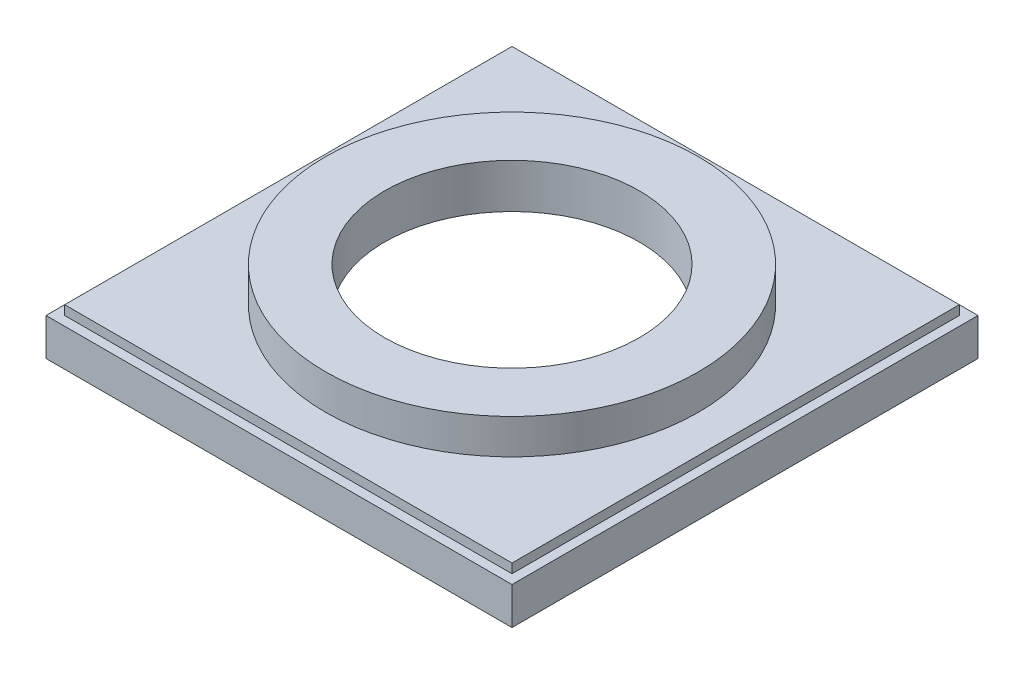
ISO-10303-21;
HEADER;
FILE_DESCRIPTION(('STEP AP214'),'2;1');
FILE_NAME('part.step','',(''),(''),'','','');
FILE_SCHEMA(('AUTOMOTIVE_DESIGN { 1 0 10303 214 1 1 1 1 }'));
ENDSEC;
DATA;
#1=APPLICATION_CONTEXT('core data for automotive mechanical design processes');
#2=APPLICATION_PROTOCOL_DEFINITION('international standard','automotive_design',2000,#1);
#3=PRODUCT_CONTEXT('',#1,'mechanical');
#4=PRODUCT('Part','Part','',(#3));
#5=PRODUCT_RELATED_PRODUCT_CATEGORY('part','',(#4));
#6=PRODUCT_DEFINITION_FORMATION('','',#4);
#7=PRODUCT_DEFINITION_CONTEXT('part definition',#1,'design');
#8=PRODUCT_DEFINITION('design','',#6,#7);
#9=PRODUCT_DEFINITION_SHAPE('','',#8);
#10=(LENGTH_UNIT() NAMED_UNIT(*) SI_UNIT(.MILLI.,.METRE.));
#11=(NAMED_UNIT(*) PLANE_ANGLE_UNIT() SI_UNIT($,.RADIAN.));
#12=(NAMED_UNIT(*) SI_UNIT($,.STERADIAN.) SOLID_ANGLE_UNIT());
#13=UNCERTAINTY_MEASURE_WITH_UNIT(LENGTH_MEASURE(1.E-05),#10,'distance_accuracy_value','');
#14=(GEOMETRIC_REPRESENTATION_CONTEXT(3) GLOBAL_UNCERTAINTY_ASSIGNED_CONTEXT((#13)) GLOBAL_UNIT_ASSIGNED_CONTEXT((#10,
#11,#12)) REPRESENTATION_CONTEXT('',''));
#15=CARTESIAN_POINT('',(0.,0.,0.));
#16=DIRECTION('',(0.,0.,1.));
#17=DIRECTION('',(1.,0.,0.));
#18=AXIS2_PLACEMENT_3D('',#15,#16,#17);
#19=CARTESIAN_POINT('',(0.,25.4,0.));
#20=DIRECTION('',(0.,1.,0.));
#21=DIRECTION('',(0.,0.,1.));
#22=AXIS2_PLACEMENT_3D('',#19,#20,#21);
#23=PLANE('',#22);
#24=DIRECTION('',(1.,0.,0.));
#25=VECTOR('',#24,1.);
#26=CARTESIAN_POINT('',(-152.4,25.4,152.4));
#27=LINE('',#26,#25);
#28=CARTESIAN_POINT('',(-152.4,25.4,152.4));
#29=VERTEX_POINT('',#28);
#30=CARTESIAN_POINT('',(152.4,25.4,152.4));
#31=VERTEX_POINT('',#30);
#32=EDGE_CURVE('E68',#29,#31,#27,.T.);
#33=ORIENTED_EDGE('',*,*,#32,.F.);
#34=DIRECTION('',(0.,0.,1.));
#35=VECTOR('',#34,1.);
#36=CARTESIAN_POINT('',(-152.4,25.4,-152.4));
#37=LINE('',#36,#35);
#38=CARTESIAN_POINT('',(-152.4,25.4,-152.4));
#39=VERTEX_POINT('',#38);
#40=EDGE_CURVE('E72',#39,#29,#37,.T.);
#41=ORIENTED_EDGE('',*,*,#40,.F.);
#42=DIRECTION('',(-1.,0.,0.));
#43=VECTOR('',#42,1.);
#44=CARTESIAN_POINT('',(152.4,25.4,-152.4));
#45=LINE('',#44,#43);
#46=CARTESIAN_POINT('',(152.4,25.4,-152.4));
#47=VERTEX_POINT('',#46);
#48=EDGE_CURVE('E495',#47,#39,#45,.T.);
#49=ORIENTED_EDGE('',*,*,#48,.F.);
#50=DIRECTION('',(0.,0.,-1.));
#51=VECTOR('',#50,1.);
#52=CARTESIAN_POINT('',(152.4,25.4,152.4));
#53=LINE('',#52,#51);
#54=EDGE_CURVE('E492',#31,#47,#53,.T.);
#55=ORIENTED_EDGE('',*,*,#54,.F.);
#56=EDGE_LOOP('',(#33,#41,#49,#55));
#57=FACE_BOUND('',#56,.T.);
#58=DIRECTION('',(0.,0.,-1.));
#59=VECTOR('',#58,1.);
#60=CARTESIAN_POINT('',(158.75,25.4,-158.75));
#61=LINE('',#60,#59);
#62=CARTESIAN_POINT('',(158.75,25.4,158.75));
#63=VERTEX_POINT('',#62);
#64=CARTESIAN_POINT('',(158.75,25.4,-158.75));
#65=VERTEX_POINT('',#64);
#66=EDGE_CURVE('E218',#63,#65,#61,.T.);
#67=ORIENTED_EDGE('',*,*,#66,.T.);
#68=DIRECTION('',(-1.,0.,0.));
#69=VECTOR('',#68,1.);
#70=CARTESIAN_POINT('',(-158.75,25.4,-158.75));
#71=LINE('',#70,#69);
#72=CARTESIAN_POINT('',(-158.75,25.4,-158.75));
#73=VERTEX_POINT('',#72);
#74=EDGE_CURVE('E222',#65,#73,#71,.T.);
#75=ORIENTED_EDGE('',*,*,#74,.T.);
#76=DIRECTION('',(0.,0.,1.));
#77=VECTOR('',#76,1.);
#78=CARTESIAN_POINT('',(-158.75,25.4,-158.75));
#79=LINE('',#78,#77);
#80=CARTESIAN_POINT('',(-158.75,25.4,158.75));
#81=VERTEX_POINT('',#80);
#82=EDGE_CURVE('E226',#73,#81,#79,.T.);
#83=ORIENTED_EDGE('',*,*,#82,.T.);
#84=DIRECTION('',(1.,0.,0.));
#85=VECTOR('',#84,1.);
#86=CARTESIAN_POINT('',(-158.75,25.4,158.75));
#87=LINE('',#86,#85);
#88=EDGE_CURVE('E229',#81,#63,#87,.T.);
#89=ORIENTED_EDGE('',*,*,#88,.T.);
#90=EDGE_LOOP('',(#67,#75,#83,#89));
#91=FACE_BOUND('',#90,.T.);
#92=ADVANCED_FACE('F51',(#57,#91),#23,.T.);
#93=CARTESIAN_POINT('',(0.,0.,0.));
#94=DIRECTION('',(0.,1.,0.));
#95=DIRECTION('',(0.,0.,1.));
#96=AXIS2_PLACEMENT_3D('',#93,#94,#95);
#97=PLANE('',#96);
#98=DIRECTION('',(0.,0.,-1.));
#99=VECTOR('',#98,1.);
#100=CARTESIAN_POINT('',(158.75,0.,-158.75));
#101=LINE('',#100,#99);
#102=CARTESIAN_POINT('',(158.75,0.,158.75));
#103=VERTEX_POINT('',#102);
#104=CARTESIAN_POINT('',(158.75,0.,-158.75));
#105=VERTEX_POINT('',#104);
#106=EDGE_CURVE('E217',#103,#105,#101,.T.);
#107=ORIENTED_EDGE('',*,*,#106,.F.);
#108=DIRECTION('',(1.,0.,0.));
#109=VECTOR('',#108,1.);
#110=CARTESIAN_POINT('',(-158.75,0.,158.75));
#111=LINE('',#110,#109);
#112=CARTESIAN_POINT('',(-158.75,0.,158.75));
#113=VERTEX_POINT('',#112);
#114=EDGE_CURVE('E223',#113,#103,#111,.T.);
#115=ORIENTED_EDGE('',*,*,#114,.F.);
#116=DIRECTION('',(0.,0.,1.));
#117=VECTOR('',#116,1.);
#118=CARTESIAN_POINT('',(-158.75,0.,-158.75));
#119=LINE('',#118,#117);
#120=CARTESIAN_POINT('',(-158.75,0.,-158.75));
#121=VERTEX_POINT('',#120);
#122=EDGE_CURVE('E239',#121,#113,#119,.T.);
#123=ORIENTED_EDGE('',*,*,#122,.F.);
#124=DIRECTION('',(-1.,0.,0.));
#125=VECTOR('',#124,1.);
#126=CARTESIAN_POINT('',(-158.75,0.,-158.75));
#127=LINE('',#126,#125);
#128=EDGE_CURVE('E236',#105,#121,#127,.T.);
#129=ORIENTED_EDGE('',*,*,#128,.F.);
#130=EDGE_LOOP('',(#107,#115,#123,#129));
#131=FACE_BOUND('',#130,.T.);
#132=DIRECTION('',(-1.,0.,0.));
#133=VECTOR('',#132,1.);
#134=CARTESIAN_POINT('',(-133.35,0.,-133.35));
#135=LINE('',#134,#133);
#136=CARTESIAN_POINT('',(133.35,0.,-133.35));
#137=VERTEX_POINT('',#136);
#138=CARTESIAN_POINT('',(-133.35,0.,-133.35));
#139=VERTEX_POINT('',#138);
#140=EDGE_CURVE('E165',#137,#139,#135,.T.);
#141=ORIENTED_EDGE('',*,*,#140,.T.);
#142=DIRECTION('',(0.,0.,1.));
#143=VECTOR('',#142,1.);
#144=CARTESIAN_POINT('',(-133.35,0.,-133.35));
#145=LINE('',#144,#143);
#146=CARTESIAN_POINT('',(-133.35,0.,133.35));
#147=VERTEX_POINT('',#146);
#148=EDGE_CURVE('E170',#139,#147,#145,.T.);
#149=ORIENTED_EDGE('',*,*,#148,.T.);
#150=DIRECTION('',(1.,0.,0.));
#151=VECTOR('',#150,1.);
#152=CARTESIAN_POINT('',(-133.35,0.,133.35));
#153=LINE('',#152,#151);
#154=CARTESIAN_POINT('',(133.35,0.,133.35));
#155=VERTEX_POINT('',#154);
#156=EDGE_CURVE('E197',#147,#155,#153,.T.);
#157=ORIENTED_EDGE('',*,*,#156,.T.);
#158=DIRECTION('',(0.,0.,-1.));
#159=VECTOR('',#158,1.);
#160=CARTESIAN_POINT('',(133.35,0.,-133.35));
#161=LINE('',#160,#159);
#162=EDGE_CURVE('E181',#155,#137,#161,.T.);
#163=ORIENTED_EDGE('',*,*,#162,.T.);
#164=EDGE_LOOP('',(#141,#149,#157,#163));
#165=FACE_BOUND('',#164,.T.);
#166=ADVANCED_FACE('F268',(#131,#165),#97,.F.);
#167=CARTESIAN_POINT('',(158.75,25.4,-158.75));
#168=DIRECTION('',(-1.,0.,0.));
#169=DIRECTION('',(0.,0.,1.));
#170=AXIS2_PLACEMENT_3D('',#167,#168,#169);
#171=PLANE('',#170);
#172=ORIENTED_EDGE('',*,*,#106,.T.);
#173=DIRECTION('',(0.,-1.,0.));
#174=VECTOR('',#173,1.);
#175=CARTESIAN_POINT('',(158.75,25.4,-158.75));
#176=LINE('',#175,#174);
#177=EDGE_CURVE('E55',#65,#105,#176,.T.);
#178=ORIENTED_EDGE('',*,*,#177,.F.);
#179=ORIENTED_EDGE('',*,*,#66,.F.);
#180=DIRECTION('',(0.,-1.,0.));
#181=VECTOR('',#180,1.);
#182=CARTESIAN_POINT('',(158.75,25.4,158.75));
#183=LINE('',#182,#181);
#184=EDGE_CURVE('E232',#63,#103,#183,.T.);
#185=ORIENTED_EDGE('',*,*,#184,.T.);
#186=EDGE_LOOP('',(#172,#178,#179,#185));
#187=FACE_BOUND('',#186,.T.);
#188=ADVANCED_FACE('F53',(#187),#171,.F.);
#189=CARTESIAN_POINT('',(-158.75,25.4,-158.75));
#190=DIRECTION('',(0.,0.,1.));
#191=DIRECTION('',(1.,0.,0.));
#192=AXIS2_PLACEMENT_3D('',#189,#190,#191);
#193=PLANE('',#192);
#194=ORIENTED_EDGE('',*,*,#128,.T.);
#195=DIRECTION('',(0.,-1.,0.));
#196=VECTOR('',#195,1.);
#197=CARTESIAN_POINT('',(-158.75,25.4,-158.75));
#198=LINE('',#197,#196);
#199=EDGE_CURVE('E250',#73,#121,#198,.T.);
#200=ORIENTED_EDGE('',*,*,#199,.F.);
#201=ORIENTED_EDGE('',*,*,#74,.F.);
#202=ORIENTED_EDGE('',*,*,#177,.T.);
#203=EDGE_LOOP('',(#194,#200,#201,#202));
#204=FACE_BOUND('',#203,.T.);
#205=ADVANCED_FACE('F261',(#204),#193,.F.);
#206=CARTESIAN_POINT('',(-158.75,25.4,-158.75));
#207=DIRECTION('',(1.,0.,0.));
#208=DIRECTION('',(0.,0.,-1.));
#209=AXIS2_PLACEMENT_3D('',#206,#207,#208);
#210=PLANE('',#209);
#211=ORIENTED_EDGE('',*,*,#122,.T.);
#212=DIRECTION('',(0.,-1.,0.));
#213=VECTOR('',#212,1.);
#214=CARTESIAN_POINT('',(-158.75,25.4,158.75));
#215=LINE('',#214,#213);
#216=EDGE_CURVE('E247',#81,#113,#215,.T.);
#217=ORIENTED_EDGE('',*,*,#216,.F.);
#218=ORIENTED_EDGE('',*,*,#82,.F.);
#219=ORIENTED_EDGE('',*,*,#199,.T.);
#220=EDGE_LOOP('',(#211,#217,#218,#219));
#221=FACE_BOUND('',#220,.T.);
#222=ADVANCED_FACE('F271',(#221),#210,.F.);
#223=CARTESIAN_POINT('',(-158.75,25.4,158.75));
#224=DIRECTION('',(0.,0.,-1.));
#225=DIRECTION('',(-1.,0.,0.));
#226=AXIS2_PLACEMENT_3D('',#223,#224,#225);
#227=PLANE('',#226);
#228=ORIENTED_EDGE('',*,*,#114,.T.);
#229=ORIENTED_EDGE('',*,*,#184,.F.);
#230=ORIENTED_EDGE('',*,*,#88,.F.);
#231=ORIENTED_EDGE('',*,*,#216,.T.);
#232=EDGE_LOOP('',(#228,#229,#230,#231));
#233=FACE_BOUND('',#232,.T.);
#234=ADVANCED_FACE('F274',(#233),#227,.F.);
#235=CARTESIAN_POINT('',(-133.35,25.4,-133.35));
#236=DIRECTION('',(0.,0.,1.));
#237=DIRECTION('',(1.,0.,0.));
#238=AXIS2_PLACEMENT_3D('',#235,#236,#237);
#239=PLANE('',#238);
#240=ORIENTED_EDGE('',*,*,#140,.F.);
#241=DIRECTION('',(0.,-1.,0.));
#242=VECTOR('',#241,1.);
#243=CARTESIAN_POINT('',(133.35,25.4,-133.35));
#244=LINE('',#243,#242);
#245=CARTESIAN_POINT('',(133.35,25.4,-133.35));
#246=VERTEX_POINT('',#245);
#247=EDGE_CURVE('E192',#246,#137,#244,.T.);
#248=ORIENTED_EDGE('',*,*,#247,.F.);
#249=DIRECTION('',(-1.,0.,0.));
#250=VECTOR('',#249,1.);
#251=CARTESIAN_POINT('',(-133.35,25.4,-133.35));
#252=LINE('',#251,#250);
#253=CARTESIAN_POINT('',(-133.35,25.4,-133.35));
#254=VERTEX_POINT('',#253);
#255=EDGE_CURVE('E176',#246,#254,#252,.T.);
#256=ORIENTED_EDGE('',*,*,#255,.T.);
#257=DIRECTION('',(0.,-1.,0.));
#258=VECTOR('',#257,1.);
#259=CARTESIAN_POINT('',(-133.35,25.4,-133.35));
#260=LINE('',#259,#258);
#261=EDGE_CURVE('E213',#254,#139,#260,.T.);
#262=ORIENTED_EDGE('',*,*,#261,.T.);
#263=EDGE_LOOP('',(#240,#248,#256,#262));
#264=FACE_BOUND('',#263,.T.);
#265=ADVANCED_FACE('F285',(#264),#239,.T.);
#266=CARTESIAN_POINT('',(-133.35,25.4,-133.35));
#267=DIRECTION('',(1.,0.,0.));
#268=DIRECTION('',(0.,0.,-1.));
#269=AXIS2_PLACEMENT_3D('',#266,#267,#268);
#270=PLANE('',#269);
#271=ORIENTED_EDGE('',*,*,#148,.F.);
#272=ORIENTED_EDGE('',*,*,#261,.F.);
#273=DIRECTION('',(0.,0.,1.));
#274=VECTOR('',#273,1.);
#275=CARTESIAN_POINT('',(-133.35,25.4,-133.35));
#276=LINE('',#275,#274);
#277=CARTESIAN_POINT('',(-133.35,25.4,133.35));
#278=VERTEX_POINT('',#277);
#279=EDGE_CURVE('E180',#254,#278,#276,.T.);
#280=ORIENTED_EDGE('',*,*,#279,.T.);
#281=DIRECTION('',(0.,-1.,0.));
#282=VECTOR('',#281,1.);
#283=CARTESIAN_POINT('',(-133.35,25.4,133.35));
#284=LINE('',#283,#282);
#285=EDGE_CURVE('E210',#278,#147,#284,.T.);
#286=ORIENTED_EDGE('',*,*,#285,.T.);
#287=EDGE_LOOP('',(#271,#272,#280,#286));
#288=FACE_BOUND('',#287,.T.);
#289=ADVANCED_FACE('F328',(#288),#270,.T.);
#290=CARTESIAN_POINT('',(-133.35,25.4,133.35));
#291=DIRECTION('',(0.,0.,-1.));
#292=DIRECTION('',(-1.,0.,0.));
#293=AXIS2_PLACEMENT_3D('',#290,#291,#292);
#294=PLANE('',#293);
#295=ORIENTED_EDGE('',*,*,#156,.F.);
#296=ORIENTED_EDGE('',*,*,#285,.F.);
#297=DIRECTION('',(1.,0.,0.));
#298=VECTOR('',#297,1.);
#299=CARTESIAN_POINT('',(-133.35,25.4,133.35));
#300=LINE('',#299,#298);
#301=CARTESIAN_POINT('',(133.35,25.4,133.35));
#302=VERTEX_POINT('',#301);
#303=EDGE_CURVE('E185',#278,#302,#300,.T.);
#304=ORIENTED_EDGE('',*,*,#303,.T.);
#305=DIRECTION('',(0.,-1.,0.));
#306=VECTOR('',#305,1.);
#307=CARTESIAN_POINT('',(133.35,25.4,133.35));
#308=LINE('',#307,#306);
#309=EDGE_CURVE('E207',#302,#155,#308,.T.);
#310=ORIENTED_EDGE('',*,*,#309,.T.);
#311=EDGE_LOOP('',(#295,#296,#304,#310));
#312=FACE_BOUND('',#311,.T.);
#313=ADVANCED_FACE('F336',(#312),#294,.T.);
#314=CARTESIAN_POINT('',(133.35,25.4,-133.35));
#315=DIRECTION('',(-1.,0.,0.));
#316=DIRECTION('',(0.,0.,1.));
#317=AXIS2_PLACEMENT_3D('',#314,#315,#316);
#318=PLANE('',#317);
#319=ORIENTED_EDGE('',*,*,#162,.F.);
#320=ORIENTED_EDGE('',*,*,#309,.F.);
#321=DIRECTION('',(0.,0.,-1.));
#322=VECTOR('',#321,1.);
#323=CARTESIAN_POINT('',(133.35,25.4,-133.35));
#324=LINE('',#323,#322);
#325=EDGE_CURVE('E189',#302,#246,#324,.T.);
#326=ORIENTED_EDGE('',*,*,#325,.T.);
#327=ORIENTED_EDGE('',*,*,#247,.T.);
#328=EDGE_LOOP('',(#319,#320,#326,#327));
#329=FACE_BOUND('',#328,.T.);
#330=ADVANCED_FACE('F344',(#329),#318,.T.);
#331=CARTESIAN_POINT('',(0.,31.75,0.));
#332=DIRECTION('',(0.,1.,0.));
#333=DIRECTION('',(0.,0.,1.));
#334=AXIS2_PLACEMENT_3D('',#331,#332,#333);
#335=PLANE('',#334);
#336=CARTESIAN_POINT('',(0.,31.75,0.));
#337=DIRECTION('',(0.,1.,0.));
#338=DIRECTION('',(0.,0.,1.));
#339=AXIS2_PLACEMENT_3D('',#336,#337,#338);
#340=CIRCLE('',#339,127.);
#341=CARTESIAN_POINT('',(0.,31.75,127.));
#342=VERTEX_POINT('',#341);
#343=EDGE_CURVE('E12',#342,#342,#340,.T.);
#344=ORIENTED_EDGE('',*,*,#343,.F.);
#345=EDGE_LOOP('',(#344));
#346=FACE_BOUND('',#345,.T.);
#347=DIRECTION('',(1.,0.,0.));
#348=VECTOR('',#347,1.);
#349=CARTESIAN_POINT('',(-152.4,31.75,152.4));
#350=LINE('',#349,#348);
#351=CARTESIAN_POINT('',(-152.4,31.75,152.4));
#352=VERTEX_POINT('',#351);
#353=CARTESIAN_POINT('',(152.4,31.75,152.4));
#354=VERTEX_POINT('',#353);
#355=EDGE_CURVE('E152',#352,#354,#350,.T.);
#356=ORIENTED_EDGE('',*,*,#355,.T.);
#357=DIRECTION('',(0.,0.,-1.));
#358=VECTOR('',#357,1.);
#359=CARTESIAN_POINT('',(152.4,31.75,152.4));
#360=LINE('',#359,#358);
#361=CARTESIAN_POINT('',(152.4,31.75,-152.4));
#362=VERTEX_POINT('',#361);
#363=EDGE_CURVE('E140',#354,#362,#360,.T.);
#364=ORIENTED_EDGE('',*,*,#363,.T.);
#365=DIRECTION('',(-1.,0.,0.));
#366=VECTOR('',#365,1.);
#367=CARTESIAN_POINT('',(152.4,31.75,-152.4));
#368=LINE('',#367,#366);
#369=CARTESIAN_POINT('',(-152.4,31.75,-152.4));
#370=VERTEX_POINT('',#369);
#371=EDGE_CURVE('E151',#362,#370,#368,.T.);
#372=ORIENTED_EDGE('',*,*,#371,.T.);
#373=DIRECTION('',(0.,0.,1.));
#374=VECTOR('',#373,1.);
#375=CARTESIAN_POINT('',(-152.4,31.75,-152.4));
#376=LINE('',#375,#374);
#377=EDGE_CURVE('E157',#370,#352,#376,.T.);
#378=ORIENTED_EDGE('',*,*,#377,.T.);
#379=EDGE_LOOP('',(#356,#364,#372,#378));
#380=FACE_BOUND('',#379,.T.);
#381=ADVANCED_FACE('F155',(#346,#380),#335,.T.);
#382=CARTESIAN_POINT('',(-152.4,31.75,-152.4));
#383=DIRECTION('',(1.,0.,0.));
#384=DIRECTION('',(0.,0.,-1.));
#385=AXIS2_PLACEMENT_3D('',#382,#383,#384);
#386=PLANE('',#385);
#387=ORIENTED_EDGE('',*,*,#40,.T.);
#388=DIRECTION('',(0.,-1.,0.));
#389=VECTOR('',#388,1.);
#390=CARTESIAN_POINT('',(-152.4,31.75,152.4));
#391=LINE('',#390,#389);
#392=EDGE_CURVE('E489',#352,#29,#391,.T.);
#393=ORIENTED_EDGE('',*,*,#392,.F.);
#394=ORIENTED_EDGE('',*,*,#377,.F.);
#395=DIRECTION('',(0.,-1.,0.));
#396=VECTOR('',#395,1.);
#397=CARTESIAN_POINT('',(-152.4,31.75,-152.4));
#398=LINE('',#397,#396);
#399=EDGE_CURVE('E172',#370,#39,#398,.T.);
#400=ORIENTED_EDGE('',*,*,#399,.T.);
#401=EDGE_LOOP('',(#387,#393,#394,#400));
#402=FACE_BOUND('',#401,.T.);
#403=ADVANCED_FACE('F361',(#402),#386,.F.);
#404=CARTESIAN_POINT('',(152.4,31.75,-152.4));
#405=DIRECTION('',(0.,0.,1.));
#406=DIRECTION('',(1.,0.,0.));
#407=AXIS2_PLACEMENT_3D('',#404,#405,#406);
#408=PLANE('',#407);
#409=ORIENTED_EDGE('',*,*,#48,.T.);
#410=ORIENTED_EDGE('',*,*,#399,.F.);
#411=ORIENTED_EDGE('',*,*,#371,.F.);
#412=DIRECTION('',(0.,-1.,0.));
#413=VECTOR('',#412,1.);
#414=CARTESIAN_POINT('',(152.4,31.75,-152.4));
#415=LINE('',#414,#413);
#416=EDGE_CURVE('E147',#362,#47,#415,.T.);
#417=ORIENTED_EDGE('',*,*,#416,.T.);
#418=EDGE_LOOP('',(#409,#410,#411,#417));
#419=FACE_BOUND('',#418,.T.);
#420=ADVANCED_FACE('F371',(#419),#408,.F.);
#421=CARTESIAN_POINT('',(152.4,31.75,152.4));
#422=DIRECTION('',(-1.,0.,0.));
#423=DIRECTION('',(0.,0.,1.));
#424=AXIS2_PLACEMENT_3D('',#421,#422,#423);
#425=PLANE('',#424);
#426=ORIENTED_EDGE('',*,*,#54,.T.);
#427=ORIENTED_EDGE('',*,*,#416,.F.);
#428=ORIENTED_EDGE('',*,*,#363,.F.);
#429=DIRECTION('',(0.,-1.,0.));
#430=VECTOR('',#429,1.);
#431=CARTESIAN_POINT('',(152.4,31.75,152.4));
#432=LINE('',#431,#430);
#433=EDGE_CURVE('E145',#354,#31,#432,.T.);
#434=ORIENTED_EDGE('',*,*,#433,.T.);
#435=EDGE_LOOP('',(#426,#427,#428,#434));
#436=FACE_BOUND('',#435,.T.);
#437=ADVANCED_FACE('F143',(#436),#425,.F.);
#438=CARTESIAN_POINT('',(-152.4,31.75,152.4));
#439=DIRECTION('',(0.,0.,-1.));
#440=DIRECTION('',(-1.,0.,0.));
#441=AXIS2_PLACEMENT_3D('',#438,#439,#440);
#442=PLANE('',#441);
#443=ORIENTED_EDGE('',*,*,#32,.T.);
#444=ORIENTED_EDGE('',*,*,#433,.F.);
#445=ORIENTED_EDGE('',*,*,#355,.F.);
#446=ORIENTED_EDGE('',*,*,#392,.T.);
#447=EDGE_LOOP('',(#443,#444,#445,#446));
#448=FACE_BOUND('',#447,.T.);
#449=ADVANCED_FACE('F163',(#448),#442,.F.);
#450=CARTESIAN_POINT('',(0.,25.4,0.));
#451=DIRECTION('',(0.,1.,0.));
#452=DIRECTION('',(0.,0.,1.));
#453=AXIS2_PLACEMENT_3D('',#450,#451,#452);
#454=PLANE('',#453);
#455=CARTESIAN_POINT('',(0.,25.4,0.));
#456=DIRECTION('',(0.,1.,0.));
#457=DIRECTION('',(0.,0.,1.));
#458=AXIS2_PLACEMENT_3D('',#455,#456,#457);
#459=CIRCLE('',#458,86.741);
#460=CARTESIAN_POINT('',(0.,25.4,86.741));
#461=VERTEX_POINT('',#460);
#462=EDGE_CURVE('E475',#461,#461,#459,.T.);
#463=ORIENTED_EDGE('',*,*,#462,.T.);
#464=EDGE_LOOP('',(#463));
#465=FACE_BOUND('',#464,.T.);
#466=ORIENTED_EDGE('',*,*,#279,.F.);
#467=ORIENTED_EDGE('',*,*,#255,.F.);
#468=ORIENTED_EDGE('',*,*,#325,.F.);
#469=ORIENTED_EDGE('',*,*,#303,.F.);
#470=EDGE_LOOP('',(#466,#467,#468,#469));
#471=FACE_BOUND('',#470,.T.);
#472=ADVANCED_FACE('F398',(#465,#471),#454,.F.);
#473=CARTESIAN_POINT('',(0.,470.462244842766,0.));
#474=DIRECTION('',(0.,-1.,0.));
#475=DIRECTION('',(0.,0.,-1.));
#476=AXIS2_PLACEMENT_3D('',#473,#474,#475);
#477=CYLINDRICAL_SURFACE('',#476,127.);
#478=ORIENTED_EDGE('',*,*,#343,.T.);
#479=EDGE_LOOP('',(#478));
#480=FACE_BOUND('',#479,.T.);
#481=CARTESIAN_POINT('',(0.,55.626,0.));
#482=DIRECTION('',(0.,1.,0.));
#483=DIRECTION('',(0.,0.,1.));
#484=AXIS2_PLACEMENT_3D('',#481,#482,#483);
#485=CIRCLE('',#484,127.);
#486=CARTESIAN_POINT('',(0.,55.626,127.));
#487=VERTEX_POINT('',#486);
#488=EDGE_CURVE('E477',#487,#487,#485,.T.);
#489=ORIENTED_EDGE('',*,*,#488,.F.);
#490=EDGE_LOOP('',(#489));
#491=FACE_BOUND('',#490,.T.);
#492=ADVANCED_FACE('F407',(#480,#491),#477,.T.);
#493=CARTESIAN_POINT('',(0.,55.626,0.));
#494=DIRECTION('',(0.,1.,0.));
#495=DIRECTION('',(0.,0.,1.));
#496=AXIS2_PLACEMENT_3D('',#493,#494,#495);
#497=PLANE('',#496);
#498=CARTESIAN_POINT('',(0.,55.626,0.));
#499=DIRECTION('',(0.,1.,0.));
#500=DIRECTION('',(0.,0.,1.));
#501=AXIS2_PLACEMENT_3D('',#498,#499,#500);
#502=CIRCLE('',#501,86.741);
#503=CARTESIAN_POINT('',(0.,55.626,86.741));
#504=VERTEX_POINT('',#503);
#505=EDGE_CURVE('E472',#504,#504,#502,.T.);
#506=ORIENTED_EDGE('',*,*,#505,.F.);
#507=EDGE_LOOP('',(#506));
#508=FACE_BOUND('',#507,.T.);
#509=ORIENTED_EDGE('',*,*,#488,.T.);
#510=EDGE_LOOP('',(#509));
#511=FACE_BOUND('',#510,.T.);
#512=ADVANCED_FACE('F417',(#508,#511),#497,.T.);
#513=CARTESIAN_POINT('',(0.,0.,0.));
#514=DIRECTION('',(0.,1.,0.));
#515=DIRECTION('',(0.,0.,1.));
#516=AXIS2_PLACEMENT_3D('',#513,#514,#515);
#517=CYLINDRICAL_SURFACE('',#516,86.741);
#518=ORIENTED_EDGE('',*,*,#505,.T.);
#519=EDGE_LOOP('',(#518));
#520=FACE_BOUND('',#519,.T.);
#521=ORIENTED_EDGE('',*,*,#462,.F.);
#522=EDGE_LOOP('',(#521));
#523=FACE_BOUND('',#522,.T.);
#524=ADVANCED_FACE('F426',(#520,#523),#517,.F.);
#525=CLOSED_SHELL('',(#92,#166,#188,#205,#222,#234,#265,#289,#313,#330,#381,#403,#420,#437,#449,
#472,#492,#512,#524));
#526=MANIFOLD_SOLID_BREP('B2',#525);
#527=ADVANCED_BREP_SHAPE_REPRESENTATION('',(#18,#526),#14);
#528=SHAPE_DEFINITION_REPRESENTATION(#9,#527);
ENDSEC;
END-ISO-10303-21;
